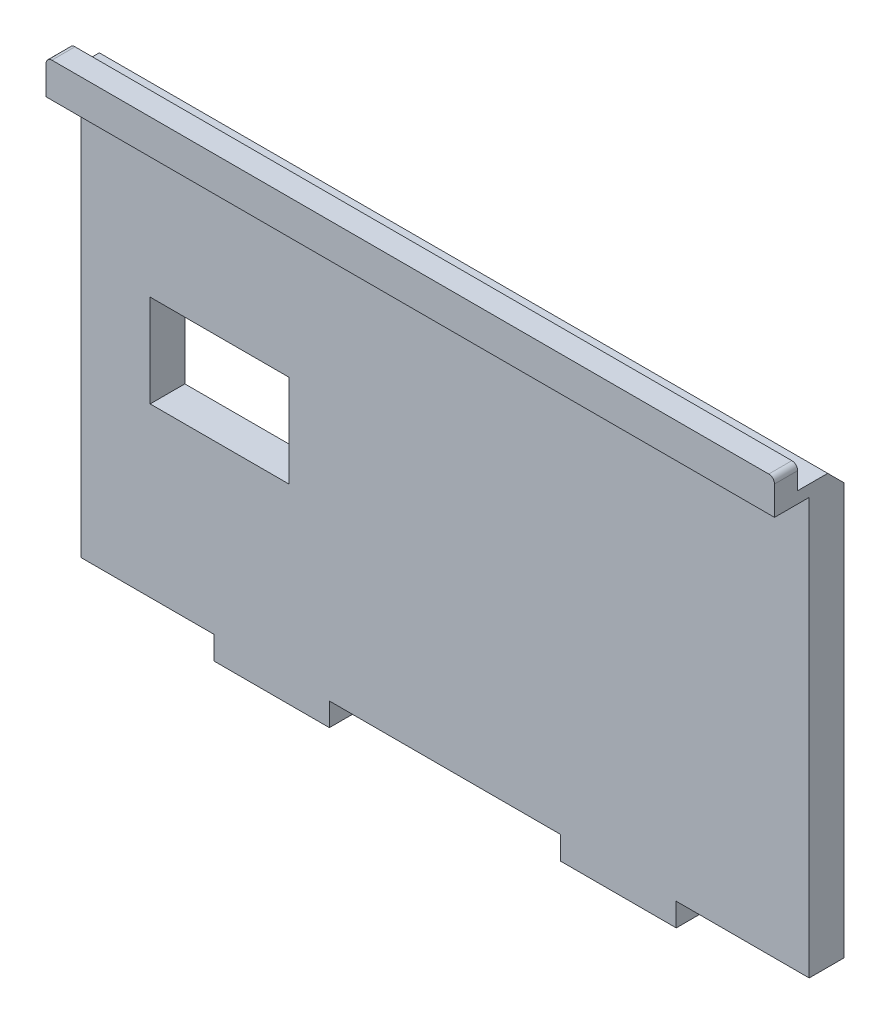
ISO-10303-21;
HEADER;
FILE_DESCRIPTION(('STEP AP214'),'2;1');
FILE_NAME('part.step','',(''),(''),'','','');
FILE_SCHEMA(('AUTOMOTIVE_DESIGN { 1 0 10303 214 1 1 1 1 }'));
ENDSEC;
DATA;
#1=APPLICATION_CONTEXT('core data for automotive mechanical design processes');
#2=APPLICATION_PROTOCOL_DEFINITION('international standard','automotive_design',2000,#1);
#3=PRODUCT_CONTEXT('',#1,'mechanical');
#4=PRODUCT('Part','Part','',(#3));
#5=PRODUCT_RELATED_PRODUCT_CATEGORY('part','',(#4));
#6=PRODUCT_DEFINITION_FORMATION('','',#4);
#7=PRODUCT_DEFINITION_CONTEXT('part definition',#1,'design');
#8=PRODUCT_DEFINITION('design','',#6,#7);
#9=PRODUCT_DEFINITION_SHAPE('','',#8);
#10=(LENGTH_UNIT() NAMED_UNIT(*) SI_UNIT(.MILLI.,.METRE.));
#11=(NAMED_UNIT(*) PLANE_ANGLE_UNIT() SI_UNIT($,.RADIAN.));
#12=(NAMED_UNIT(*) SI_UNIT($,.STERADIAN.) SOLID_ANGLE_UNIT());
#13=UNCERTAINTY_MEASURE_WITH_UNIT(LENGTH_MEASURE(1.E-05),#10,'distance_accuracy_value','');
#14=(GEOMETRIC_REPRESENTATION_CONTEXT(3) GLOBAL_UNCERTAINTY_ASSIGNED_CONTEXT((#13)) GLOBAL_UNIT_ASSIGNED_CONTEXT((#10,
#11,#12)) REPRESENTATION_CONTEXT('',''));
#15=CARTESIAN_POINT('',(0.,0.,0.));
#16=DIRECTION('',(0.,0.,1.));
#17=DIRECTION('',(1.,0.,0.));
#18=AXIS2_PLACEMENT_3D('',#15,#16,#17);
#19=CARTESIAN_POINT('',(-31.5,18.5,3.));
#20=DIRECTION('',(0.,-1.,0.));
#21=DIRECTION('',(0.,0.,-1.));
#22=AXIS2_PLACEMENT_3D('',#19,#20,#21);
#23=PLANE('',#22);
#24=DIRECTION('',(0.,0.,-1.));
#25=VECTOR('',#24,1.);
#26=CARTESIAN_POINT('',(31.5,18.5,3.));
#27=LINE('',#26,#25);
#28=CARTESIAN_POINT('',(31.5,18.5,4.));
#29=VERTEX_POINT('',#28);
#30=CARTESIAN_POINT('',(31.5,18.5,1.40000000000001));
#31=VERTEX_POINT('',#30);
#32=EDGE_CURVE('E210',#29,#31,#27,.T.);
#33=ORIENTED_EDGE('',*,*,#32,.T.);
#34=DIRECTION('',(-1.,0.,0.));
#35=VECTOR('',#34,1.);
#36=CARTESIAN_POINT('',(-31.5,18.5,1.40000000000001));
#37=LINE('',#36,#35);
#38=CARTESIAN_POINT('',(-31.5,18.5,1.40000000000001));
#39=VERTEX_POINT('',#38);
#40=EDGE_CURVE('E209',#31,#39,#37,.T.);
#41=ORIENTED_EDGE('',*,*,#40,.T.);
#42=DIRECTION('',(0.,0.,-1.));
#43=VECTOR('',#42,1.);
#44=CARTESIAN_POINT('',(-31.5,18.5,3.));
#45=LINE('',#44,#43);
#46=CARTESIAN_POINT('',(-31.5,18.5,4.00000000000001));
#47=VERTEX_POINT('',#46);
#48=EDGE_CURVE('E196',#47,#39,#45,.T.);
#49=ORIENTED_EDGE('',*,*,#48,.F.);
#50=DIRECTION('',(-1.,0.,0.));
#51=VECTOR('',#50,1.);
#52=CARTESIAN_POINT('',(31.5,18.5,4.));
#53=LINE('',#52,#51);
#54=EDGE_CURVE('E206',#29,#47,#53,.T.);
#55=ORIENTED_EDGE('',*,*,#54,.F.);
#56=EDGE_LOOP('',(#33,#41,#49,#55));
#57=FACE_BOUND('',#56,.T.);
#58=ADVANCED_FACE('F40',(#57),#23,.F.);
#59=CARTESIAN_POINT('',(0.,0.,3.));
#60=DIRECTION('',(0.,0.,-1.));
#61=DIRECTION('',(-1.,0.,0.));
#62=AXIS2_PLACEMENT_3D('',#59,#60,#61);
#63=PLANE('',#62);
#64=DIRECTION('',(1.,0.,0.));
#65=VECTOR('',#64,1.);
#66=CARTESIAN_POINT('',(-25.5,-3.99999999999996,3.));
#67=LINE('',#66,#65);
#68=CARTESIAN_POINT('',(-25.5,-3.99999999999996,3.));
#69=VERTEX_POINT('',#68);
#70=CARTESIAN_POINT('',(-13.5,-3.99999999999996,3.));
#71=VERTEX_POINT('',#70);
#72=EDGE_CURVE('E237',#69,#71,#67,.T.);
#73=ORIENTED_EDGE('',*,*,#72,.F.);
#74=DIRECTION('',(0.,-1.,0.));
#75=VECTOR('',#74,1.);
#76=CARTESIAN_POINT('',(-25.5,-3.99999999999996,3.));
#77=LINE('',#76,#75);
#78=CARTESIAN_POINT('',(-25.5,4.00000000000004,3.));
#79=VERTEX_POINT('',#78);
#80=EDGE_CURVE('E221',#79,#69,#77,.T.);
#81=ORIENTED_EDGE('',*,*,#80,.F.);
#82=DIRECTION('',(-1.,0.,0.));
#83=VECTOR('',#82,1.);
#84=CARTESIAN_POINT('',(-25.5,4.00000000000004,3.));
#85=LINE('',#84,#83);
#86=CARTESIAN_POINT('',(-13.5,4.00000000000004,3.));
#87=VERTEX_POINT('',#86);
#88=EDGE_CURVE('E226',#87,#79,#85,.T.);
#89=ORIENTED_EDGE('',*,*,#88,.F.);
#90=DIRECTION('',(0.,1.,0.));
#91=VECTOR('',#90,1.);
#92=CARTESIAN_POINT('',(-13.5,-3.99999999999996,3.));
#93=LINE('',#92,#91);
#94=EDGE_CURVE('E240',#71,#87,#93,.T.);
#95=ORIENTED_EDGE('',*,*,#94,.F.);
#96=EDGE_LOOP('',(#73,#81,#89,#95));
#97=FACE_BOUND('',#96,.T.);
#98=DIRECTION('',(1.,0.,0.));
#99=VECTOR('',#98,1.);
#100=CARTESIAN_POINT('',(-31.5,17.5,3.));
#101=LINE('',#100,#99);
#102=CARTESIAN_POINT('',(-31.5,17.5,3.));
#103=VERTEX_POINT('',#102);
#104=CARTESIAN_POINT('',(31.5,17.5,3.));
#105=VERTEX_POINT('',#104);
#106=EDGE_CURVE('E247',#103,#105,#101,.T.);
#107=ORIENTED_EDGE('',*,*,#106,.F.);
#108=DIRECTION('',(0.,-1.,0.));
#109=VECTOR('',#108,1.);
#110=CARTESIAN_POINT('',(-31.5,-18.5,3.));
#111=LINE('',#110,#109);
#112=CARTESIAN_POINT('',(-31.5,-18.5,3.));
#113=VERTEX_POINT('',#112);
#114=EDGE_CURVE('E328',#103,#113,#111,.T.);
#115=ORIENTED_EDGE('',*,*,#114,.T.);
#116=DIRECTION('',(1.,0.,0.));
#117=VECTOR('',#116,1.);
#118=CARTESIAN_POINT('',(-31.5,-18.5,3.));
#119=LINE('',#118,#117);
#120=CARTESIAN_POINT('',(-20.,-18.5,3.));
#121=VERTEX_POINT('',#120);
#122=EDGE_CURVE('E332',#113,#121,#119,.T.);
#123=ORIENTED_EDGE('',*,*,#122,.T.);
#124=DIRECTION('',(0.,1.,0.));
#125=VECTOR('',#124,1.);
#126=CARTESIAN_POINT('',(-20.,-20.5,3.));
#127=LINE('',#126,#125);
#128=CARTESIAN_POINT('',(-20.,-20.5,3.));
#129=VERTEX_POINT('',#128);
#130=EDGE_CURVE('E319',#129,#121,#127,.T.);
#131=ORIENTED_EDGE('',*,*,#130,.F.);
#132=DIRECTION('',(-1.,0.,0.));
#133=VECTOR('',#132,1.);
#134=CARTESIAN_POINT('',(-20.,-20.5,3.));
#135=LINE('',#134,#133);
#136=CARTESIAN_POINT('',(-10.,-20.5,3.));
#137=VERTEX_POINT('',#136);
#138=EDGE_CURVE('E299',#137,#129,#135,.T.);
#139=ORIENTED_EDGE('',*,*,#138,.F.);
#140=DIRECTION('',(0.,1.,0.));
#141=VECTOR('',#140,1.);
#142=CARTESIAN_POINT('',(-10.,-20.5,3.));
#143=LINE('',#142,#141);
#144=CARTESIAN_POINT('',(-10.,-18.5,3.));
#145=VERTEX_POINT('',#144);
#146=EDGE_CURVE('E322',#137,#145,#143,.T.);
#147=ORIENTED_EDGE('',*,*,#146,.T.);
#148=CARTESIAN_POINT('',(10.,-18.5,3.));
#149=VERTEX_POINT('',#148);
#150=EDGE_CURVE('E336',#145,#149,#119,.T.);
#151=ORIENTED_EDGE('',*,*,#150,.T.);
#152=DIRECTION('',(0.,1.,0.));
#153=VECTOR('',#152,1.);
#154=CARTESIAN_POINT('',(10.,-20.5,3.));
#155=LINE('',#154,#153);
#156=CARTESIAN_POINT('',(10.,-20.5,3.));
#157=VERTEX_POINT('',#156);
#158=EDGE_CURVE('E290',#157,#149,#155,.T.);
#159=ORIENTED_EDGE('',*,*,#158,.F.);
#160=DIRECTION('',(-1.,0.,0.));
#161=VECTOR('',#160,1.);
#162=CARTESIAN_POINT('',(20.,-20.5,3.));
#163=LINE('',#162,#161);
#164=CARTESIAN_POINT('',(20.,-20.5,3.));
#165=VERTEX_POINT('',#164);
#166=EDGE_CURVE('E273',#165,#157,#163,.T.);
#167=ORIENTED_EDGE('',*,*,#166,.F.);
#168=DIRECTION('',(0.,1.,0.));
#169=VECTOR('',#168,1.);
#170=CARTESIAN_POINT('',(20.,-20.5,3.));
#171=LINE('',#170,#169);
#172=CARTESIAN_POINT('',(20.,-18.5,3.));
#173=VERTEX_POINT('',#172);
#174=EDGE_CURVE('E292',#165,#173,#171,.T.);
#175=ORIENTED_EDGE('',*,*,#174,.T.);
#176=CARTESIAN_POINT('',(31.5,-18.5,3.));
#177=VERTEX_POINT('',#176);
#178=EDGE_CURVE('E331',#173,#177,#119,.T.);
#179=ORIENTED_EDGE('',*,*,#178,.T.);
#180=DIRECTION('',(0.,1.,0.));
#181=VECTOR('',#180,1.);
#182=CARTESIAN_POINT('',(31.5,-18.5,3.));
#183=LINE('',#182,#181);
#184=EDGE_CURVE('E326',#177,#105,#183,.T.);
#185=ORIENTED_EDGE('',*,*,#184,.T.);
#186=EDGE_LOOP('',(#107,#115,#123,#131,#139,#147,#151,#159,#167,#175,#179,#185));
#187=FACE_BOUND('',#186,.T.);
#188=ADVANCED_FACE('F405',(#97,#187),#63,.F.);
#189=CARTESIAN_POINT('',(-31.5,-18.5,3.));
#190=DIRECTION('',(0.,1.,0.));
#191=DIRECTION('',(0.,0.,1.));
#192=AXIS2_PLACEMENT_3D('',#189,#190,#191);
#193=PLANE('',#192);
#194=DIRECTION('',(0.,0.,1.));
#195=VECTOR('',#194,1.);
#196=CARTESIAN_POINT('',(20.,-18.5,1.00000000000001));
#197=LINE('',#196,#195);
#198=CARTESIAN_POINT('',(20.,-18.5,1.00000000000001));
#199=VERTEX_POINT('',#198);
#200=EDGE_CURVE('E269',#199,#173,#197,.T.);
#201=ORIENTED_EDGE('',*,*,#200,.F.);
#202=DIRECTION('',(1.,0.,0.));
#203=VECTOR('',#202,1.);
#204=CARTESIAN_POINT('',(20.,-18.5,1.00000000000001));
#205=LINE('',#204,#203);
#206=CARTESIAN_POINT('',(10.,-18.5,1.));
#207=VERTEX_POINT('',#206);
#208=EDGE_CURVE('E274',#207,#199,#205,.T.);
#209=ORIENTED_EDGE('',*,*,#208,.F.);
#210=DIRECTION('',(0.,0.,-1.));
#211=VECTOR('',#210,1.);
#212=CARTESIAN_POINT('',(10.,-18.5,1.));
#213=LINE('',#212,#211);
#214=EDGE_CURVE('E282',#149,#207,#213,.T.);
#215=ORIENTED_EDGE('',*,*,#214,.F.);
#216=ORIENTED_EDGE('',*,*,#150,.F.);
#217=DIRECTION('',(0.,0.,1.));
#218=VECTOR('',#217,1.);
#219=CARTESIAN_POINT('',(-10.,-18.5,1.));
#220=LINE('',#219,#218);
#221=CARTESIAN_POINT('',(-10.,-18.5,1.));
#222=VERTEX_POINT('',#221);
#223=EDGE_CURVE('E295',#222,#145,#220,.T.);
#224=ORIENTED_EDGE('',*,*,#223,.F.);
#225=DIRECTION('',(1.,0.,0.));
#226=VECTOR('',#225,1.);
#227=CARTESIAN_POINT('',(-20.,-18.5,1.));
#228=LINE('',#227,#226);
#229=CARTESIAN_POINT('',(-20.,-18.5,1.));
#230=VERTEX_POINT('',#229);
#231=EDGE_CURVE('E300',#230,#222,#228,.T.);
#232=ORIENTED_EDGE('',*,*,#231,.F.);
#233=DIRECTION('',(0.,0.,-1.));
#234=VECTOR('',#233,1.);
#235=CARTESIAN_POINT('',(-20.,-18.5,1.));
#236=LINE('',#235,#234);
#237=EDGE_CURVE('E309',#121,#230,#236,.T.);
#238=ORIENTED_EDGE('',*,*,#237,.F.);
#239=ORIENTED_EDGE('',*,*,#122,.F.);
#240=DIRECTION('',(0.,0.,-1.));
#241=VECTOR('',#240,1.);
#242=CARTESIAN_POINT('',(-31.5,-18.5,3.));
#243=LINE('',#242,#241);
#244=CARTESIAN_POINT('',(-31.5,-18.5,0.));
#245=VERTEX_POINT('',#244);
#246=EDGE_CURVE('E211',#113,#245,#243,.T.);
#247=ORIENTED_EDGE('',*,*,#246,.T.);
#248=DIRECTION('',(1.,0.,0.));
#249=VECTOR('',#248,1.);
#250=CARTESIAN_POINT('',(-31.5,-18.5,0.));
#251=LINE('',#250,#249);
#252=CARTESIAN_POINT('',(31.5,-18.5,0.));
#253=VERTEX_POINT('',#252);
#254=EDGE_CURVE('E329',#245,#253,#251,.T.);
#255=ORIENTED_EDGE('',*,*,#254,.T.);
#256=DIRECTION('',(0.,0.,-1.));
#257=VECTOR('',#256,1.);
#258=CARTESIAN_POINT('',(31.5,-18.5,3.));
#259=LINE('',#258,#257);
#260=EDGE_CURVE('E335',#177,#253,#259,.T.);
#261=ORIENTED_EDGE('',*,*,#260,.F.);
#262=ORIENTED_EDGE('',*,*,#178,.F.);
#263=EDGE_LOOP('',(#201,#209,#215,#216,#224,#232,#238,#239,#247,#255,#261,#262));
#264=FACE_BOUND('',#263,.T.);
#265=ADVANCED_FACE('F400',(#264),#193,.F.);
#266=CARTESIAN_POINT('',(31.5,-18.5,3.));
#267=DIRECTION('',(-1.,0.,0.));
#268=DIRECTION('',(0.,0.,1.));
#269=AXIS2_PLACEMENT_3D('',#266,#267,#268);
#270=PLANE('',#269);
#271=DIRECTION('',(0.,-1.,0.));
#272=VECTOR('',#271,1.);
#273=CARTESIAN_POINT('',(31.5,20.5,4.));
#274=LINE('',#273,#272);
#275=CARTESIAN_POINT('',(31.5,20.,4.));
#276=VERTEX_POINT('',#275);
#277=EDGE_CURVE('E199',#276,#29,#274,.T.);
#278=ORIENTED_EDGE('',*,*,#277,.F.);
#279=DIRECTION('',(0.,0.,-1.));
#280=VECTOR('',#279,1.);
#281=CARTESIAN_POINT('',(31.5,20.,6.));
#282=LINE('',#281,#280);
#283=CARTESIAN_POINT('',(31.5,20.,6.));
#284=VERTEX_POINT('',#283);
#285=EDGE_CURVE('E11',#276,#284,#282,.F.);
#286=ORIENTED_EDGE('',*,*,#285,.T.);
#287=DIRECTION('',(0.,1.,0.));
#288=VECTOR('',#287,1.);
#289=CARTESIAN_POINT('',(31.5,17.5,6.));
#290=LINE('',#289,#288);
#291=CARTESIAN_POINT('',(31.5,17.5,6.));
#292=VERTEX_POINT('',#291);
#293=EDGE_CURVE('E258',#292,#284,#290,.T.);
#294=ORIENTED_EDGE('',*,*,#293,.F.);
#295=DIRECTION('',(0.,0.,-1.));
#296=VECTOR('',#295,1.);
#297=CARTESIAN_POINT('',(31.5,17.5,6.));
#298=LINE('',#297,#296);
#299=EDGE_CURVE('E261',#292,#105,#298,.T.);
#300=ORIENTED_EDGE('',*,*,#299,.T.);
#301=ORIENTED_EDGE('',*,*,#184,.F.);
#302=ORIENTED_EDGE('',*,*,#260,.T.);
#303=DIRECTION('',(0.,1.,0.));
#304=VECTOR('',#303,1.);
#305=CARTESIAN_POINT('',(31.5,-18.5,0.));
#306=LINE('',#305,#304);
#307=CARTESIAN_POINT('',(31.5,17.1,0.));
#308=VERTEX_POINT('',#307);
#309=EDGE_CURVE('E325',#253,#308,#306,.T.);
#310=ORIENTED_EDGE('',*,*,#309,.T.);
#311=DIRECTION('',(0.,0.707106781186548,0.707106781186548));
#312=VECTOR('',#311,1.);
#313=CARTESIAN_POINT('',(31.5,18.5,1.40000000000001));
#314=LINE('',#313,#312);
#315=EDGE_CURVE('E352',#308,#31,#314,.T.);
#316=ORIENTED_EDGE('',*,*,#315,.T.);
#317=ORIENTED_EDGE('',*,*,#32,.F.);
#318=EDGE_LOOP('',(#278,#286,#294,#300,#301,#302,#310,#316,#317));
#319=FACE_BOUND('',#318,.T.);
#320=ADVANCED_FACE('F387',(#319),#270,.F.);
#321=CARTESIAN_POINT('',(-31.5,-18.5,3.));
#322=DIRECTION('',(1.,0.,0.));
#323=DIRECTION('',(0.,0.,-1.));
#324=AXIS2_PLACEMENT_3D('',#321,#322,#323);
#325=PLANE('',#324);
#326=DIRECTION('',(0.,-1.,0.));
#327=VECTOR('',#326,1.);
#328=CARTESIAN_POINT('',(-31.5,17.5,6.));
#329=LINE('',#328,#327);
#330=CARTESIAN_POINT('',(-31.5,20.,6.));
#331=VERTEX_POINT('',#330);
#332=CARTESIAN_POINT('',(-31.5,17.5,6.));
#333=VERTEX_POINT('',#332);
#334=EDGE_CURVE('E254',#331,#333,#329,.T.);
#335=ORIENTED_EDGE('',*,*,#334,.F.);
#336=DIRECTION('',(0.,0.,1.));
#337=VECTOR('',#336,1.);
#338=CARTESIAN_POINT('',(-31.5,20.,4.00000000000001));
#339=LINE('',#338,#337);
#340=CARTESIAN_POINT('',(-31.5,20.,4.00000000000001));
#341=VERTEX_POINT('',#340);
#342=EDGE_CURVE('E63',#331,#341,#339,.F.);
#343=ORIENTED_EDGE('',*,*,#342,.T.);
#344=DIRECTION('',(0.,-1.,0.));
#345=VECTOR('',#344,1.);
#346=CARTESIAN_POINT('',(-31.5,20.5,4.00000000000001));
#347=LINE('',#346,#345);
#348=EDGE_CURVE('E193',#341,#47,#347,.T.);
#349=ORIENTED_EDGE('',*,*,#348,.T.);
#350=ORIENTED_EDGE('',*,*,#48,.T.);
#351=DIRECTION('',(0.,-0.707106781186548,-0.707106781186548));
#352=VECTOR('',#351,1.);
#353=CARTESIAN_POINT('',(-31.5,18.5,1.40000000000001));
#354=LINE('',#353,#352);
#355=CARTESIAN_POINT('',(-31.5,17.1,0.));
#356=VERTEX_POINT('',#355);
#357=EDGE_CURVE('E348',#39,#356,#354,.T.);
#358=ORIENTED_EDGE('',*,*,#357,.T.);
#359=DIRECTION('',(0.,-1.,0.));
#360=VECTOR('',#359,1.);
#361=CARTESIAN_POINT('',(-31.5,-18.5,0.));
#362=LINE('',#361,#360);
#363=EDGE_CURVE('E339',#356,#245,#362,.T.);
#364=ORIENTED_EDGE('',*,*,#363,.T.);
#365=ORIENTED_EDGE('',*,*,#246,.F.);
#366=ORIENTED_EDGE('',*,*,#114,.F.);
#367=DIRECTION('',(0.,0.,-1.));
#368=VECTOR('',#367,1.);
#369=CARTESIAN_POINT('',(-31.5,17.5,6.));
#370=LINE('',#369,#368);
#371=EDGE_CURVE('E266',#333,#103,#370,.T.);
#372=ORIENTED_EDGE('',*,*,#371,.F.);
#373=EDGE_LOOP('',(#335,#343,#349,#350,#358,#364,#365,#366,#372));
#374=FACE_BOUND('',#373,.T.);
#375=ADVANCED_FACE('F195',(#374),#325,.F.);
#376=CARTESIAN_POINT('',(0.,0.,0.));
#377=DIRECTION('',(0.,0.,-1.));
#378=DIRECTION('',(-1.,0.,0.));
#379=AXIS2_PLACEMENT_3D('',#376,#377,#378);
#380=PLANE('',#379);
#381=DIRECTION('',(0.,-1.,0.));
#382=VECTOR('',#381,1.);
#383=CARTESIAN_POINT('',(-25.5,-3.99999999999996,0.));
#384=LINE('',#383,#382);
#385=CARTESIAN_POINT('',(-25.5,4.00000000000004,0.));
#386=VERTEX_POINT('',#385);
#387=CARTESIAN_POINT('',(-25.5,-3.99999999999996,0.));
#388=VERTEX_POINT('',#387);
#389=EDGE_CURVE('E222',#386,#388,#384,.T.);
#390=ORIENTED_EDGE('',*,*,#389,.T.);
#391=DIRECTION('',(1.,0.,0.));
#392=VECTOR('',#391,1.);
#393=CARTESIAN_POINT('',(-25.5,-3.99999999999996,0.));
#394=LINE('',#393,#392);
#395=CARTESIAN_POINT('',(-13.5,-3.99999999999996,0.));
#396=VERTEX_POINT('',#395);
#397=EDGE_CURVE('E225',#388,#396,#394,.T.);
#398=ORIENTED_EDGE('',*,*,#397,.T.);
#399=DIRECTION('',(0.,1.,0.));
#400=VECTOR('',#399,1.);
#401=CARTESIAN_POINT('',(-13.5,-3.99999999999996,0.));
#402=LINE('',#401,#400);
#403=CARTESIAN_POINT('',(-13.5,4.00000000000004,0.));
#404=VERTEX_POINT('',#403);
#405=EDGE_CURVE('E229',#396,#404,#402,.T.);
#406=ORIENTED_EDGE('',*,*,#405,.T.);
#407=DIRECTION('',(-1.,0.,0.));
#408=VECTOR('',#407,1.);
#409=CARTESIAN_POINT('',(-25.5,4.00000000000004,0.));
#410=LINE('',#409,#408);
#411=EDGE_CURVE('E232',#404,#386,#410,.T.);
#412=ORIENTED_EDGE('',*,*,#411,.T.);
#413=EDGE_LOOP('',(#390,#398,#406,#412));
#414=FACE_BOUND('',#413,.T.);
#415=ORIENTED_EDGE('',*,*,#363,.F.);
#416=DIRECTION('',(1.,0.,0.));
#417=VECTOR('',#416,1.);
#418=CARTESIAN_POINT('',(31.5,17.1,0.));
#419=LINE('',#418,#417);
#420=EDGE_CURVE('E350',#356,#308,#419,.T.);
#421=ORIENTED_EDGE('',*,*,#420,.T.);
#422=ORIENTED_EDGE('',*,*,#309,.F.);
#423=ORIENTED_EDGE('',*,*,#254,.F.);
#424=EDGE_LOOP('',(#415,#421,#422,#423));
#425=FACE_BOUND('',#424,.T.);
#426=ADVANCED_FACE('F395',(#414,#425),#380,.T.);
#427=CARTESIAN_POINT('',(-10.,-20.5,1.));
#428=DIRECTION('',(-1.,0.,0.));
#429=DIRECTION('',(0.,0.,1.));
#430=AXIS2_PLACEMENT_3D('',#427,#428,#429);
#431=PLANE('',#430);
#432=ORIENTED_EDGE('',*,*,#223,.T.);
#433=ORIENTED_EDGE('',*,*,#146,.F.);
#434=DIRECTION('',(0.,0.,1.));
#435=VECTOR('',#434,1.);
#436=CARTESIAN_POINT('',(-10.,-20.5,1.));
#437=LINE('',#436,#435);
#438=CARTESIAN_POINT('',(-10.,-20.5,1.));
#439=VERTEX_POINT('',#438);
#440=EDGE_CURVE('E296',#439,#137,#437,.T.);
#441=ORIENTED_EDGE('',*,*,#440,.F.);
#442=DIRECTION('',(0.,1.,0.));
#443=VECTOR('',#442,1.);
#444=CARTESIAN_POINT('',(-10.,-20.5,1.));
#445=LINE('',#444,#443);
#446=EDGE_CURVE('E306',#439,#222,#445,.T.);
#447=ORIENTED_EDGE('',*,*,#446,.T.);
#448=EDGE_LOOP('',(#432,#433,#441,#447));
#449=FACE_BOUND('',#448,.T.);
#450=ADVANCED_FACE('F523',(#449),#431,.F.);
#451=CARTESIAN_POINT('',(-20.,-20.5,1.));
#452=DIRECTION('',(1.,0.,0.));
#453=DIRECTION('',(0.,0.,-1.));
#454=AXIS2_PLACEMENT_3D('',#451,#452,#453);
#455=PLANE('',#454);
#456=ORIENTED_EDGE('',*,*,#237,.T.);
#457=DIRECTION('',(0.,1.,0.));
#458=VECTOR('',#457,1.);
#459=CARTESIAN_POINT('',(-20.,-20.5,1.));
#460=LINE('',#459,#458);
#461=CARTESIAN_POINT('',(-20.,-20.5,1.));
#462=VERTEX_POINT('',#461);
#463=EDGE_CURVE('E316',#462,#230,#460,.T.);
#464=ORIENTED_EDGE('',*,*,#463,.F.);
#465=DIRECTION('',(0.,0.,-1.));
#466=VECTOR('',#465,1.);
#467=CARTESIAN_POINT('',(-20.,-20.5,1.));
#468=LINE('',#467,#466);
#469=EDGE_CURVE('E302',#129,#462,#468,.T.);
#470=ORIENTED_EDGE('',*,*,#469,.F.);
#471=ORIENTED_EDGE('',*,*,#130,.T.);
#472=EDGE_LOOP('',(#456,#464,#470,#471));
#473=FACE_BOUND('',#472,.T.);
#474=ADVANCED_FACE('F624',(#473),#455,.F.);
#475=CARTESIAN_POINT('',(-20.,-20.5,1.));
#476=DIRECTION('',(0.,0.,1.));
#477=DIRECTION('',(1.,0.,0.));
#478=AXIS2_PLACEMENT_3D('',#475,#476,#477);
#479=PLANE('',#478);
#480=ORIENTED_EDGE('',*,*,#231,.T.);
#481=ORIENTED_EDGE('',*,*,#446,.F.);
#482=DIRECTION('',(1.,0.,0.));
#483=VECTOR('',#482,1.);
#484=CARTESIAN_POINT('',(-20.,-20.5,1.));
#485=LINE('',#484,#483);
#486=EDGE_CURVE('E304',#462,#439,#485,.T.);
#487=ORIENTED_EDGE('',*,*,#486,.F.);
#488=ORIENTED_EDGE('',*,*,#463,.T.);
#489=EDGE_LOOP('',(#480,#481,#487,#488));
#490=FACE_BOUND('',#489,.T.);
#491=ADVANCED_FACE('F433',(#490),#479,.F.);
#492=CARTESIAN_POINT('',(0.,-20.5,0.));
#493=DIRECTION('',(0.,1.,0.));
#494=DIRECTION('',(0.,0.,1.));
#495=AXIS2_PLACEMENT_3D('',#492,#493,#494);
#496=PLANE('',#495);
#497=ORIENTED_EDGE('',*,*,#440,.T.);
#498=ORIENTED_EDGE('',*,*,#138,.T.);
#499=ORIENTED_EDGE('',*,*,#469,.T.);
#500=ORIENTED_EDGE('',*,*,#486,.T.);
#501=EDGE_LOOP('',(#497,#498,#499,#500));
#502=FACE_BOUND('',#501,.T.);
#503=ADVANCED_FACE('F426',(#502),#496,.F.);
#504=CARTESIAN_POINT('',(20.,-20.5,1.00000000000001));
#505=DIRECTION('',(-1.,0.,0.));
#506=DIRECTION('',(0.,0.,1.));
#507=AXIS2_PLACEMENT_3D('',#504,#505,#506);
#508=PLANE('',#507);
#509=ORIENTED_EDGE('',*,*,#200,.T.);
#510=ORIENTED_EDGE('',*,*,#174,.F.);
#511=DIRECTION('',(0.,0.,1.));
#512=VECTOR('',#511,1.);
#513=CARTESIAN_POINT('',(20.,-20.5,1.00000000000001));
#514=LINE('',#513,#512);
#515=CARTESIAN_POINT('',(20.,-20.5,1.00000000000001));
#516=VERTEX_POINT('',#515);
#517=EDGE_CURVE('E270',#516,#165,#514,.T.);
#518=ORIENTED_EDGE('',*,*,#517,.F.);
#519=DIRECTION('',(0.,1.,0.));
#520=VECTOR('',#519,1.);
#521=CARTESIAN_POINT('',(20.,-20.5,1.00000000000001));
#522=LINE('',#521,#520);
#523=EDGE_CURVE('E280',#516,#199,#522,.T.);
#524=ORIENTED_EDGE('',*,*,#523,.T.);
#525=EDGE_LOOP('',(#509,#510,#518,#524));
#526=FACE_BOUND('',#525,.T.);
#527=ADVANCED_FACE('F424',(#526),#508,.F.);
#528=CARTESIAN_POINT('',(10.,-20.5,1.));
#529=DIRECTION('',(1.,0.,0.));
#530=DIRECTION('',(0.,0.,-1.));
#531=AXIS2_PLACEMENT_3D('',#528,#529,#530);
#532=PLANE('',#531);
#533=ORIENTED_EDGE('',*,*,#214,.T.);
#534=DIRECTION('',(0.,1.,0.));
#535=VECTOR('',#534,1.);
#536=CARTESIAN_POINT('',(10.,-20.5,1.));
#537=LINE('',#536,#535);
#538=CARTESIAN_POINT('',(10.,-20.5,1.));
#539=VERTEX_POINT('',#538);
#540=EDGE_CURVE('E287',#539,#207,#537,.T.);
#541=ORIENTED_EDGE('',*,*,#540,.F.);
#542=DIRECTION('',(0.,0.,-1.));
#543=VECTOR('',#542,1.);
#544=CARTESIAN_POINT('',(10.,-20.5,1.));
#545=LINE('',#544,#543);
#546=EDGE_CURVE('E276',#157,#539,#545,.T.);
#547=ORIENTED_EDGE('',*,*,#546,.F.);
#548=ORIENTED_EDGE('',*,*,#158,.T.);
#549=EDGE_LOOP('',(#533,#541,#547,#548));
#550=FACE_BOUND('',#549,.T.);
#551=ADVANCED_FACE('F415',(#550),#532,.F.);
#552=CARTESIAN_POINT('',(20.,-20.5,1.00000000000001));
#553=DIRECTION('',(0.,0.,1.));
#554=DIRECTION('',(1.,0.,0.));
#555=AXIS2_PLACEMENT_3D('',#552,#553,#554);
#556=PLANE('',#555);
#557=ORIENTED_EDGE('',*,*,#208,.T.);
#558=ORIENTED_EDGE('',*,*,#523,.F.);
#559=DIRECTION('',(1.,0.,0.));
#560=VECTOR('',#559,1.);
#561=CARTESIAN_POINT('',(20.,-20.5,1.00000000000001));
#562=LINE('',#561,#560);
#563=EDGE_CURVE('E278',#539,#516,#562,.T.);
#564=ORIENTED_EDGE('',*,*,#563,.F.);
#565=ORIENTED_EDGE('',*,*,#540,.T.);
#566=EDGE_LOOP('',(#557,#558,#564,#565));
#567=FACE_BOUND('',#566,.T.);
#568=ADVANCED_FACE('F418',(#567),#556,.F.);
#569=CARTESIAN_POINT('',(0.,-20.5,0.));
#570=DIRECTION('',(0.,-1.,0.));
#571=DIRECTION('',(0.,0.,-1.));
#572=AXIS2_PLACEMENT_3D('',#569,#570,#571);
#573=PLANE('',#572);
#574=ORIENTED_EDGE('',*,*,#517,.T.);
#575=ORIENTED_EDGE('',*,*,#166,.T.);
#576=ORIENTED_EDGE('',*,*,#546,.T.);
#577=ORIENTED_EDGE('',*,*,#563,.T.);
#578=EDGE_LOOP('',(#574,#575,#576,#577));
#579=FACE_BOUND('',#578,.T.);
#580=ADVANCED_FACE('F422',(#579),#573,.T.);
#581=CARTESIAN_POINT('',(-31.5,17.5,6.));
#582=DIRECTION('',(0.,1.,0.));
#583=DIRECTION('',(0.,0.,1.));
#584=AXIS2_PLACEMENT_3D('',#581,#582,#583);
#585=PLANE('',#584);
#586=ORIENTED_EDGE('',*,*,#106,.T.);
#587=ORIENTED_EDGE('',*,*,#299,.F.);
#588=DIRECTION('',(1.,0.,0.));
#589=VECTOR('',#588,1.);
#590=CARTESIAN_POINT('',(-31.5,17.5,6.));
#591=LINE('',#590,#589);
#592=EDGE_CURVE('E256',#333,#292,#591,.T.);
#593=ORIENTED_EDGE('',*,*,#592,.F.);
#594=ORIENTED_EDGE('',*,*,#371,.T.);
#595=EDGE_LOOP('',(#586,#587,#593,#594));
#596=FACE_BOUND('',#595,.T.);
#597=ADVANCED_FACE('F380',(#596),#585,.F.);
#598=CARTESIAN_POINT('',(0.,0.,6.));
#599=DIRECTION('',(0.,0.,-1.));
#600=DIRECTION('',(-1.,0.,0.));
#601=AXIS2_PLACEMENT_3D('',#598,#599,#600);
#602=PLANE('',#601);
#603=DIRECTION('',(1.,0.,0.));
#604=VECTOR('',#603,1.);
#605=CARTESIAN_POINT('',(31.5,20.5,6.));
#606=LINE('',#605,#604);
#607=CARTESIAN_POINT('',(-31.,20.5,6.));
#608=VERTEX_POINT('',#607);
#609=CARTESIAN_POINT('',(31.,20.5,6.));
#610=VERTEX_POINT('',#609);
#611=EDGE_CURVE('E200',#608,#610,#606,.T.);
#612=ORIENTED_EDGE('',*,*,#611,.F.);
#613=CARTESIAN_POINT('',(-31.,20.,6.));
#614=DIRECTION('',(0.,0.,-1.));
#615=DIRECTION('',(-1.,0.,0.));
#616=AXIS2_PLACEMENT_3D('',#613,#614,#615);
#617=CIRCLE('',#616,0.5);
#618=EDGE_CURVE('E362',#608,#331,#617,.F.);
#619=ORIENTED_EDGE('',*,*,#618,.T.);
#620=ORIENTED_EDGE('',*,*,#334,.T.);
#621=ORIENTED_EDGE('',*,*,#592,.T.);
#622=ORIENTED_EDGE('',*,*,#293,.T.);
#623=CARTESIAN_POINT('',(31.,20.,6.));
#624=DIRECTION('',(0.,0.,-1.));
#625=DIRECTION('',(-1.,0.,0.));
#626=AXIS2_PLACEMENT_3D('',#623,#624,#625);
#627=CIRCLE('',#626,0.5);
#628=EDGE_CURVE('E360',#284,#610,#627,.F.);
#629=ORIENTED_EDGE('',*,*,#628,.T.);
#630=EDGE_LOOP('',(#612,#619,#620,#621,#622,#629));
#631=FACE_BOUND('',#630,.T.);
#632=ADVANCED_FACE('F374',(#631),#602,.F.);
#633=CARTESIAN_POINT('',(-25.5,-3.99999999999996,0.));
#634=DIRECTION('',(-1.,0.,0.));
#635=DIRECTION('',(0.,0.,1.));
#636=AXIS2_PLACEMENT_3D('',#633,#634,#635);
#637=PLANE('',#636);
#638=ORIENTED_EDGE('',*,*,#80,.T.);
#639=DIRECTION('',(0.,0.,1.));
#640=VECTOR('',#639,1.);
#641=CARTESIAN_POINT('',(-25.5,-3.99999999999996,0.));
#642=LINE('',#641,#640);
#643=EDGE_CURVE('E235',#388,#69,#642,.T.);
#644=ORIENTED_EDGE('',*,*,#643,.F.);
#645=ORIENTED_EDGE('',*,*,#389,.F.);
#646=DIRECTION('',(0.,0.,1.));
#647=VECTOR('',#646,1.);
#648=CARTESIAN_POINT('',(-25.5,4.00000000000004,0.));
#649=LINE('',#648,#647);
#650=EDGE_CURVE('E245',#386,#79,#649,.T.);
#651=ORIENTED_EDGE('',*,*,#650,.T.);
#652=EDGE_LOOP('',(#638,#644,#645,#651));
#653=FACE_BOUND('',#652,.T.);
#654=ADVANCED_FACE('F490',(#653),#637,.F.);
#655=CARTESIAN_POINT('',(-25.5,4.00000000000004,0.));
#656=DIRECTION('',(0.,1.,0.));
#657=DIRECTION('',(0.,0.,1.));
#658=AXIS2_PLACEMENT_3D('',#655,#656,#657);
#659=PLANE('',#658);
#660=ORIENTED_EDGE('',*,*,#88,.T.);
#661=ORIENTED_EDGE('',*,*,#650,.F.);
#662=ORIENTED_EDGE('',*,*,#411,.F.);
#663=DIRECTION('',(0.,0.,1.));
#664=VECTOR('',#663,1.);
#665=CARTESIAN_POINT('',(-13.5,4.00000000000004,0.));
#666=LINE('',#665,#664);
#667=EDGE_CURVE('E248',#404,#87,#666,.T.);
#668=ORIENTED_EDGE('',*,*,#667,.T.);
#669=EDGE_LOOP('',(#660,#661,#662,#668));
#670=FACE_BOUND('',#669,.T.);
#671=ADVANCED_FACE('F550',(#670),#659,.F.);
#672=CARTESIAN_POINT('',(-13.5,-3.99999999999996,0.));
#673=DIRECTION('',(1.,0.,0.));
#674=DIRECTION('',(0.,0.,-1.));
#675=AXIS2_PLACEMENT_3D('',#672,#673,#674);
#676=PLANE('',#675);
#677=ORIENTED_EDGE('',*,*,#94,.T.);
#678=ORIENTED_EDGE('',*,*,#667,.F.);
#679=ORIENTED_EDGE('',*,*,#405,.F.);
#680=DIRECTION('',(0.,0.,1.));
#681=VECTOR('',#680,1.);
#682=CARTESIAN_POINT('',(-13.5,-3.99999999999996,0.));
#683=LINE('',#682,#681);
#684=EDGE_CURVE('E250',#396,#71,#683,.T.);
#685=ORIENTED_EDGE('',*,*,#684,.T.);
#686=EDGE_LOOP('',(#677,#678,#679,#685));
#687=FACE_BOUND('',#686,.T.);
#688=ADVANCED_FACE('F540',(#687),#676,.F.);
#689=CARTESIAN_POINT('',(-25.5,-3.99999999999996,0.));
#690=DIRECTION('',(0.,-1.,0.));
#691=DIRECTION('',(0.,0.,-1.));
#692=AXIS2_PLACEMENT_3D('',#689,#690,#691);
#693=PLANE('',#692);
#694=ORIENTED_EDGE('',*,*,#72,.T.);
#695=ORIENTED_EDGE('',*,*,#684,.F.);
#696=ORIENTED_EDGE('',*,*,#397,.F.);
#697=ORIENTED_EDGE('',*,*,#643,.T.);
#698=EDGE_LOOP('',(#694,#695,#696,#697));
#699=FACE_BOUND('',#698,.T.);
#700=ADVANCED_FACE('F480',(#699),#693,.F.);
#701=CARTESIAN_POINT('',(31.5,20.5,4.));
#702=DIRECTION('',(0.,0.,1.));
#703=DIRECTION('',(1.,0.,0.));
#704=AXIS2_PLACEMENT_3D('',#701,#702,#703);
#705=PLANE('',#704);
#706=ORIENTED_EDGE('',*,*,#348,.F.);
#707=CARTESIAN_POINT('',(-31.,20.,4.00000000000001));
#708=DIRECTION('',(0.,0.,1.));
#709=DIRECTION('',(1.,0.,0.));
#710=AXIS2_PLACEMENT_3D('',#707,#708,#709);
#711=CIRCLE('',#710,0.5);
#712=CARTESIAN_POINT('',(-31.,20.5,4.00000000000001));
#713=VERTEX_POINT('',#712);
#714=EDGE_CURVE('E48',#341,#713,#711,.F.);
#715=ORIENTED_EDGE('',*,*,#714,.T.);
#716=DIRECTION('',(-1.,0.,0.));
#717=VECTOR('',#716,1.);
#718=CARTESIAN_POINT('',(31.5,20.5,4.));
#719=LINE('',#718,#717);
#720=CARTESIAN_POINT('',(31.,20.5,4.));
#721=VERTEX_POINT('',#720);
#722=EDGE_CURVE('E214',#721,#713,#719,.T.);
#723=ORIENTED_EDGE('',*,*,#722,.F.);
#724=CARTESIAN_POINT('',(31.,20.,4.));
#725=DIRECTION('',(0.,0.,1.));
#726=DIRECTION('',(1.,0.,0.));
#727=AXIS2_PLACEMENT_3D('',#724,#725,#726);
#728=CIRCLE('',#727,0.5);
#729=EDGE_CURVE('E55',#721,#276,#728,.F.);
#730=ORIENTED_EDGE('',*,*,#729,.T.);
#731=ORIENTED_EDGE('',*,*,#277,.T.);
#732=ORIENTED_EDGE('',*,*,#54,.T.);
#733=EDGE_LOOP('',(#706,#715,#723,#730,#731,#732));
#734=FACE_BOUND('',#733,.T.);
#735=ADVANCED_FACE('F213',(#734),#705,.F.);
#736=CARTESIAN_POINT('',(0.,20.5,0.));
#737=DIRECTION('',(0.,1.,0.));
#738=DIRECTION('',(0.,0.,1.));
#739=AXIS2_PLACEMENT_3D('',#736,#737,#738);
#740=PLANE('',#739);
#741=ORIENTED_EDGE('',*,*,#722,.T.);
#742=DIRECTION('',(0.,0.,1.));
#743=VECTOR('',#742,1.);
#744=CARTESIAN_POINT('',(-31.,20.5,6.));
#745=LINE('',#744,#743);
#746=EDGE_CURVE('E357',#713,#608,#745,.T.);
#747=ORIENTED_EDGE('',*,*,#746,.T.);
#748=ORIENTED_EDGE('',*,*,#611,.T.);
#749=DIRECTION('',(0.,0.,-1.));
#750=VECTOR('',#749,1.);
#751=CARTESIAN_POINT('',(31.,20.5,4.));
#752=LINE('',#751,#750);
#753=EDGE_CURVE('E354',#610,#721,#752,.T.);
#754=ORIENTED_EDGE('',*,*,#753,.T.);
#755=EDGE_LOOP('',(#741,#747,#748,#754));
#756=FACE_BOUND('',#755,.T.);
#757=ADVANCED_FACE('F368',(#756),#740,.T.);
#758=CARTESIAN_POINT('',(-31.5,18.5,1.40000000000001));
#759=DIRECTION('',(0.,0.707106781186548,-0.707106781186548));
#760=DIRECTION('',(1.,0.,0.));
#761=AXIS2_PLACEMENT_3D('',#758,#759,#760);
#762=PLANE('',#761);
#763=ORIENTED_EDGE('',*,*,#315,.F.);
#764=ORIENTED_EDGE('',*,*,#420,.F.);
#765=ORIENTED_EDGE('',*,*,#357,.F.);
#766=ORIENTED_EDGE('',*,*,#40,.F.);
#767=EDGE_LOOP('',(#763,#764,#765,#766));
#768=FACE_BOUND('',#767,.T.);
#769=ADVANCED_FACE('F390',(#768),#762,.T.);
#770=CARTESIAN_POINT('',(-31.,20.,0.));
#771=DIRECTION('',(0.,0.,-1.));
#772=DIRECTION('',(-1.,0.,0.));
#773=AXIS2_PLACEMENT_3D('',#770,#771,#772);
#774=CYLINDRICAL_SURFACE('',#773,0.5);
#775=ORIENTED_EDGE('',*,*,#714,.F.);
#776=ORIENTED_EDGE('',*,*,#342,.F.);
#777=ORIENTED_EDGE('',*,*,#618,.F.);
#778=ORIENTED_EDGE('',*,*,#746,.F.);
#779=EDGE_LOOP('',(#775,#776,#777,#778));
#780=FACE_BOUND('',#779,.T.);
#781=ADVANCED_FACE('F372',(#780),#774,.T.);
#782=CARTESIAN_POINT('',(31.,20.,0.));
#783=DIRECTION('',(0.,0.,1.));
#784=DIRECTION('',(1.,0.,0.));
#785=AXIS2_PLACEMENT_3D('',#782,#783,#784);
#786=CYLINDRICAL_SURFACE('',#785,0.5);
#787=ORIENTED_EDGE('',*,*,#628,.F.);
#788=ORIENTED_EDGE('',*,*,#285,.F.);
#789=ORIENTED_EDGE('',*,*,#729,.F.);
#790=ORIENTED_EDGE('',*,*,#753,.F.);
#791=EDGE_LOOP('',(#787,#788,#789,#790));
#792=FACE_BOUND('',#791,.T.);
#793=ADVANCED_FACE('F42',(#792),#786,.T.);
#794=CLOSED_SHELL('',(#58,#188,#265,#320,#375,#426,#450,#474,#491,#503,#527,#551,#568,#580,#597,
#632,#654,#671,#688,#700,#735,#757,#769,#781,#793));
#795=MANIFOLD_SOLID_BREP('B2',#794);
#796=ADVANCED_BREP_SHAPE_REPRESENTATION('',(#18,#795),#14);
#797=SHAPE_DEFINITION_REPRESENTATION(#9,#796);
ENDSEC;
END-ISO-10303-21;
